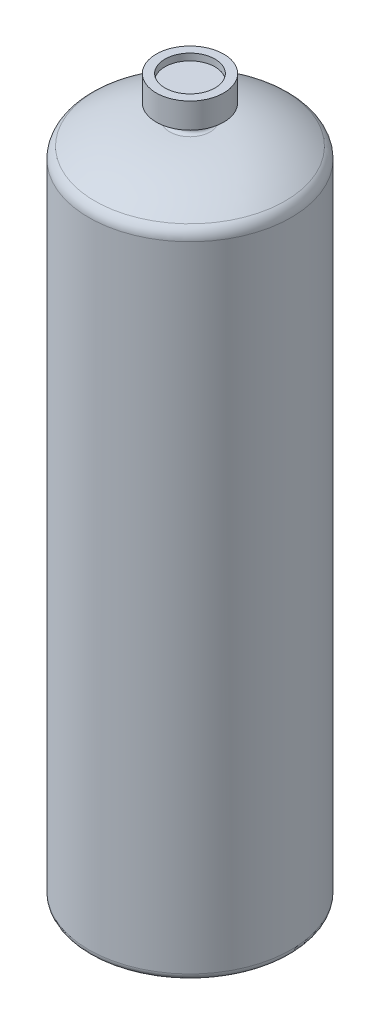
ISO-10303-21;
HEADER;
FILE_DESCRIPTION(('STEP AP214'),'2;1');
FILE_NAME('part.step','',(''),(''),'','','');
FILE_SCHEMA(('AUTOMOTIVE_DESIGN { 1 0 10303 214 1 1 1 1 }'));
ENDSEC;
DATA;
#1=APPLICATION_CONTEXT('core data for automotive mechanical design processes');
#2=APPLICATION_PROTOCOL_DEFINITION('international standard','automotive_design',2000,#1);
#3=PRODUCT_CONTEXT('',#1,'mechanical');
#4=PRODUCT('Part','Part','',(#3));
#5=PRODUCT_RELATED_PRODUCT_CATEGORY('part','',(#4));
#6=PRODUCT_DEFINITION_FORMATION('','',#4);
#7=PRODUCT_DEFINITION_CONTEXT('part definition',#1,'design');
#8=PRODUCT_DEFINITION('design','',#6,#7);
#9=PRODUCT_DEFINITION_SHAPE('','',#8);
#10=(LENGTH_UNIT() NAMED_UNIT(*) SI_UNIT(.MILLI.,.METRE.));
#11=(NAMED_UNIT(*) PLANE_ANGLE_UNIT() SI_UNIT($,.RADIAN.));
#12=(NAMED_UNIT(*) SI_UNIT($,.STERADIAN.) SOLID_ANGLE_UNIT());
#13=UNCERTAINTY_MEASURE_WITH_UNIT(LENGTH_MEASURE(1.E-05),#10,'distance_accuracy_value','');
#14=(GEOMETRIC_REPRESENTATION_CONTEXT(3) GLOBAL_UNCERTAINTY_ASSIGNED_CONTEXT((#13)) GLOBAL_UNIT_ASSIGNED_CONTEXT((#10,
#11,#12)) REPRESENTATION_CONTEXT('',''));
#15=CARTESIAN_POINT('',(0.,0.,0.));
#16=DIRECTION('',(0.,0.,1.));
#17=DIRECTION('',(1.,0.,0.));
#18=AXIS2_PLACEMENT_3D('',#15,#16,#17);
#19=CARTESIAN_POINT('',(-12.7,269.24,0.));
#20=DIRECTION('',(0.,-1.,0.));
#21=DIRECTION('',(0.,0.,-1.));
#22=AXIS2_PLACEMENT_3D('',#19,#20,#21);
#23=PLANE('',#22);
#24=CARTESIAN_POINT('',(0.,269.24,0.));
#25=DIRECTION('',(0.,1.,0.));
#26=DIRECTION('',(0.,0.,1.));
#27=AXIS2_PLACEMENT_3D('',#24,#25,#26);
#28=CIRCLE('',#27,9.42682190489988);
#29=CARTESIAN_POINT('',(0.,269.24,9.42682190489988));
#30=VERTEX_POINT('',#29);
#31=EDGE_CURVE('E78',#30,#30,#28,.T.);
#32=ORIENTED_EDGE('',*,*,#31,.F.);
#33=EDGE_LOOP('',(#32));
#34=FACE_BOUND('',#33,.T.);
#35=CARTESIAN_POINT('',(0.,269.24,0.));
#36=DIRECTION('',(0.,-1.,0.));
#37=DIRECTION('',(0.,0.,-1.));
#38=AXIS2_PLACEMENT_3D('',#35,#36,#37);
#39=CIRCLE('',#38,12.7);
#40=CARTESIAN_POINT('',(0.,269.24,-12.7));
#41=VERTEX_POINT('',#40);
#42=EDGE_CURVE('E53',#41,#41,#39,.T.);
#43=ORIENTED_EDGE('',*,*,#42,.F.);
#44=EDGE_LOOP('',(#43));
#45=FACE_BOUND('',#44,.T.);
#46=ADVANCED_FACE('F42',(#34,#45),#23,.F.);
#47=CARTESIAN_POINT('',(0.,0.,0.));
#48=DIRECTION('',(0.,-1.,0.));
#49=DIRECTION('',(0.,0.,-1.));
#50=AXIS2_PLACEMENT_3D('',#47,#48,#49);
#51=CYLINDRICAL_SURFACE('',#50,12.7);
#52=CARTESIAN_POINT('',(0.,259.715,0.));
#53=DIRECTION('',(0.,-1.,0.));
#54=DIRECTION('',(0.,0.,-1.));
#55=AXIS2_PLACEMENT_3D('',#52,#53,#54);
#56=CIRCLE('',#55,12.7);
#57=CARTESIAN_POINT('',(0.,259.715,-12.7));
#58=VERTEX_POINT('',#57);
#59=EDGE_CURVE('E57',#58,#58,#56,.T.);
#60=ORIENTED_EDGE('',*,*,#59,.F.);
#61=EDGE_LOOP('',(#60));
#62=FACE_BOUND('',#61,.T.);
#63=ORIENTED_EDGE('',*,*,#42,.T.);
#64=EDGE_LOOP('',(#63));
#65=FACE_BOUND('',#64,.T.);
#66=ADVANCED_FACE('F94',(#62,#65),#51,.T.);
#67=CARTESIAN_POINT('',(-6.35,259.715,0.));
#68=DIRECTION('',(0.,1.,0.));
#69=DIRECTION('',(0.,0.,1.));
#70=AXIS2_PLACEMENT_3D('',#67,#68,#69);
#71=PLANE('',#70);
#72=CARTESIAN_POINT('',(0.,259.715,0.));
#73=DIRECTION('',(0.,-1.,0.));
#74=DIRECTION('',(0.,0.,-1.));
#75=AXIS2_PLACEMENT_3D('',#72,#73,#74);
#76=CIRCLE('',#75,6.35);
#77=CARTESIAN_POINT('',(0.,259.715,-6.35));
#78=VERTEX_POINT('',#77);
#79=EDGE_CURVE('E62',#78,#78,#76,.T.);
#80=ORIENTED_EDGE('',*,*,#79,.F.);
#81=EDGE_LOOP('',(#80));
#82=FACE_BOUND('',#81,.T.);
#83=ORIENTED_EDGE('',*,*,#59,.T.);
#84=EDGE_LOOP('',(#83));
#85=FACE_BOUND('',#84,.T.);
#86=ADVANCED_FACE('F98',(#82,#85),#71,.F.);
#87=CARTESIAN_POINT('',(0.,0.,0.));
#88=DIRECTION('',(0.,-1.,0.));
#89=DIRECTION('',(0.,0.,-1.));
#90=AXIS2_PLACEMENT_3D('',#87,#88,#89);
#91=CYLINDRICAL_SURFACE('',#90,6.35000000000001);
#92=CARTESIAN_POINT('',(0.,255.27,0.));
#93=DIRECTION('',(0.,-1.,0.));
#94=DIRECTION('',(0.,0.,-1.));
#95=AXIS2_PLACEMENT_3D('',#92,#93,#94);
#96=CIRCLE('',#95,6.35000000000001);
#97=CARTESIAN_POINT('',(0.,255.27,-6.35000000000001));
#98=VERTEX_POINT('',#97);
#99=EDGE_CURVE('E65',#98,#98,#96,.T.);
#100=ORIENTED_EDGE('',*,*,#99,.F.);
#101=EDGE_LOOP('',(#100));
#102=FACE_BOUND('',#101,.T.);
#103=ORIENTED_EDGE('',*,*,#79,.T.);
#104=EDGE_LOOP('',(#103));
#105=FACE_BOUND('',#104,.T.);
#106=ADVANCED_FACE('F104',(#102,#105),#91,.T.);
#107=CARTESIAN_POINT('',(0.,255.27,0.));
#108=DIRECTION('',(0.,-1.,0.));
#109=DIRECTION('',(0.,0.,-1.));
#110=AXIS2_PLACEMENT_3D('',#107,#108,#109);
#111=TOROIDAL_SURFACE('',#110,7.62,1.27);
#112=CARTESIAN_POINT('',(0.,254.,0.));
#113=DIRECTION('',(0.,-1.,0.));
#114=DIRECTION('',(0.,0.,-1.));
#115=AXIS2_PLACEMENT_3D('',#112,#113,#114);
#116=CIRCLE('',#115,7.62000000000001);
#117=CARTESIAN_POINT('',(0.,254.,-7.62000000000001));
#118=VERTEX_POINT('',#117);
#119=EDGE_CURVE('E68',#118,#118,#116,.T.);
#120=ORIENTED_EDGE('',*,*,#119,.F.);
#121=EDGE_LOOP('',(#120));
#122=FACE_BOUND('',#121,.T.);
#123=ORIENTED_EDGE('',*,*,#99,.T.);
#124=EDGE_LOOP('',(#123));
#125=FACE_BOUND('',#124,.T.);
#126=ADVANCED_FACE('F111',(#122,#125),#111,.F.);
#127=CARTESIAN_POINT('',(0.,202.776666666667,0.));
#128=DIRECTION('',(0.,-1.,0.));
#129=DIRECTION('',(0.,0.,-1.));
#130=AXIS2_PLACEMENT_3D('',#127,#128,#129);
#131=DEGENERATE_TOROIDAL_SURFACE('',#130,7.62000000000001,51.2233333333332,.T.);
#132=CARTESIAN_POINT('',(0.,245.541100917431,0.));
#133=DIRECTION('',(0.,-1.,0.));
#134=DIRECTION('',(0.,0.,-1.));
#135=AXIS2_PLACEMENT_3D('',#132,#133,#134);
#136=CIRCLE('',#135,35.8163302752294);
#137=CARTESIAN_POINT('',(0.,245.541100917431,-35.8163302752294));
#138=VERTEX_POINT('',#137);
#139=EDGE_CURVE('E71',#138,#138,#136,.T.);
#140=ORIENTED_EDGE('',*,*,#139,.F.);
#141=EDGE_LOOP('',(#140));
#142=FACE_BOUND('',#141,.T.);
#143=ORIENTED_EDGE('',*,*,#119,.T.);
#144=EDGE_LOOP('',(#143));
#145=FACE_BOUND('',#144,.T.);
#146=ADVANCED_FACE('F115',(#142,#145),#131,.T.);
#147=CARTESIAN_POINT('',(0.,241.3,0.));
#148=DIRECTION('',(0.,-1.,0.));
#149=DIRECTION('',(0.,0.,-1.));
#150=AXIS2_PLACEMENT_3D('',#147,#148,#149);
#151=TOROIDAL_SURFACE('',#150,33.02,5.07999999999997);
#152=CARTESIAN_POINT('',(0.,241.3,0.));
#153=DIRECTION('',(0.,-1.,0.));
#154=DIRECTION('',(0.,0.,-1.));
#155=AXIS2_PLACEMENT_3D('',#152,#153,#154);
#156=CIRCLE('',#155,38.1);
#157=CARTESIAN_POINT('',(0.,241.3,-38.1));
#158=VERTEX_POINT('',#157);
#159=EDGE_CURVE('E74',#158,#158,#156,.T.);
#160=ORIENTED_EDGE('',*,*,#159,.F.);
#161=EDGE_LOOP('',(#160));
#162=FACE_BOUND('',#161,.T.);
#163=ORIENTED_EDGE('',*,*,#139,.T.);
#164=EDGE_LOOP('',(#163));
#165=FACE_BOUND('',#164,.T.);
#166=ADVANCED_FACE('F119',(#162,#165),#151,.T.);
#167=CARTESIAN_POINT('',(0.,0.,0.));
#168=DIRECTION('',(0.,-1.,0.));
#169=DIRECTION('',(0.,0.,-1.));
#170=AXIS2_PLACEMENT_3D('',#167,#168,#169);
#171=CYLINDRICAL_SURFACE('',#170,38.1);
#172=CARTESIAN_POINT('',(0.,2.54,0.));
#173=DIRECTION('',(0.,1.,0.));
#174=DIRECTION('',(0.,0.,1.));
#175=AXIS2_PLACEMENT_3D('',#172,#173,#174);
#176=CIRCLE('',#175,38.1);
#177=CARTESIAN_POINT('',(0.,2.54,38.1));
#178=VERTEX_POINT('',#177);
#179=EDGE_CURVE('E12',#178,#178,#176,.T.);
#180=ORIENTED_EDGE('',*,*,#179,.T.);
#181=EDGE_LOOP('',(#180));
#182=FACE_BOUND('',#181,.T.);
#183=ORIENTED_EDGE('',*,*,#159,.T.);
#184=EDGE_LOOP('',(#183));
#185=FACE_BOUND('',#184,.T.);
#186=ADVANCED_FACE('F123',(#182,#185),#171,.T.);
#187=CARTESIAN_POINT('',(0.,0.,0.));
#188=DIRECTION('',(0.,1.,0.));
#189=DIRECTION('',(0.,0.,1.));
#190=AXIS2_PLACEMENT_3D('',#187,#188,#189);
#191=PLANE('',#190);
#192=CARTESIAN_POINT('',(0.,0.,0.));
#193=DIRECTION('',(0.,1.,0.));
#194=DIRECTION('',(0.,0.,1.));
#195=AXIS2_PLACEMENT_3D('',#192,#193,#194);
#196=CIRCLE('',#195,35.56);
#197=CARTESIAN_POINT('',(0.,0.,35.56));
#198=VERTEX_POINT('',#197);
#199=EDGE_CURVE('E49',#198,#198,#196,.F.);
#200=ORIENTED_EDGE('',*,*,#199,.T.);
#201=EDGE_LOOP('',(#200));
#202=FACE_BOUND('',#201,.T.);
#203=ADVANCED_FACE('F127',(#202),#191,.F.);
#204=CARTESIAN_POINT('',(0.,2.54,0.));
#205=DIRECTION('',(0.,1.,0.));
#206=DIRECTION('',(0.,0.,1.));
#207=AXIS2_PLACEMENT_3D('',#204,#205,#206);
#208=TOROIDAL_SURFACE('',#207,35.56,2.54);
#209=ORIENTED_EDGE('',*,*,#179,.F.);
#210=EDGE_LOOP('',(#209));
#211=FACE_BOUND('',#210,.T.);
#212=ORIENTED_EDGE('',*,*,#199,.F.);
#213=EDGE_LOOP('',(#212));
#214=FACE_BOUND('',#213,.T.);
#215=ADVANCED_FACE('F44',(#211,#214),#208,.T.);
#216=CARTESIAN_POINT('',(0.,266.7,0.));
#217=DIRECTION('',(0.,1.,0.));
#218=DIRECTION('',(0.,0.,1.));
#219=AXIS2_PLACEMENT_3D('',#216,#217,#218);
#220=CYLINDRICAL_SURFACE('',#219,9.42682190489988);
#221=CARTESIAN_POINT('',(0.,266.7,0.));
#222=DIRECTION('',(0.,1.,0.));
#223=DIRECTION('',(0.,0.,1.));
#224=AXIS2_PLACEMENT_3D('',#221,#222,#223);
#225=CIRCLE('',#224,9.42682190489988);
#226=CARTESIAN_POINT('',(0.,266.7,9.42682190489988));
#227=VERTEX_POINT('',#226);
#228=EDGE_CURVE('E77',#227,#227,#225,.T.);
#229=ORIENTED_EDGE('',*,*,#228,.F.);
#230=EDGE_LOOP('',(#229));
#231=FACE_BOUND('',#230,.T.);
#232=ORIENTED_EDGE('',*,*,#31,.T.);
#233=EDGE_LOOP('',(#232));
#234=FACE_BOUND('',#233,.T.);
#235=ADVANCED_FACE('F86',(#231,#234),#220,.F.);
#236=CARTESIAN_POINT('',(0.,266.7,0.));
#237=DIRECTION('',(0.,1.,0.));
#238=DIRECTION('',(0.,0.,1.));
#239=AXIS2_PLACEMENT_3D('',#236,#237,#238);
#240=PLANE('',#239);
#241=ORIENTED_EDGE('',*,*,#228,.T.);
#242=EDGE_LOOP('',(#241));
#243=FACE_BOUND('',#242,.T.);
#244=ADVANCED_FACE('F84',(#243),#240,.T.);
#245=CLOSED_SHELL('',(#46,#66,#86,#106,#126,#146,#166,#186,#203,#215,#235,#244));
#246=MANIFOLD_SOLID_BREP('B2',#245);
#247=ADVANCED_BREP_SHAPE_REPRESENTATION('',(#18,#246),#14);
#248=SHAPE_DEFINITION_REPRESENTATION(#9,#247);
ENDSEC;
END-ISO-10303-21;
